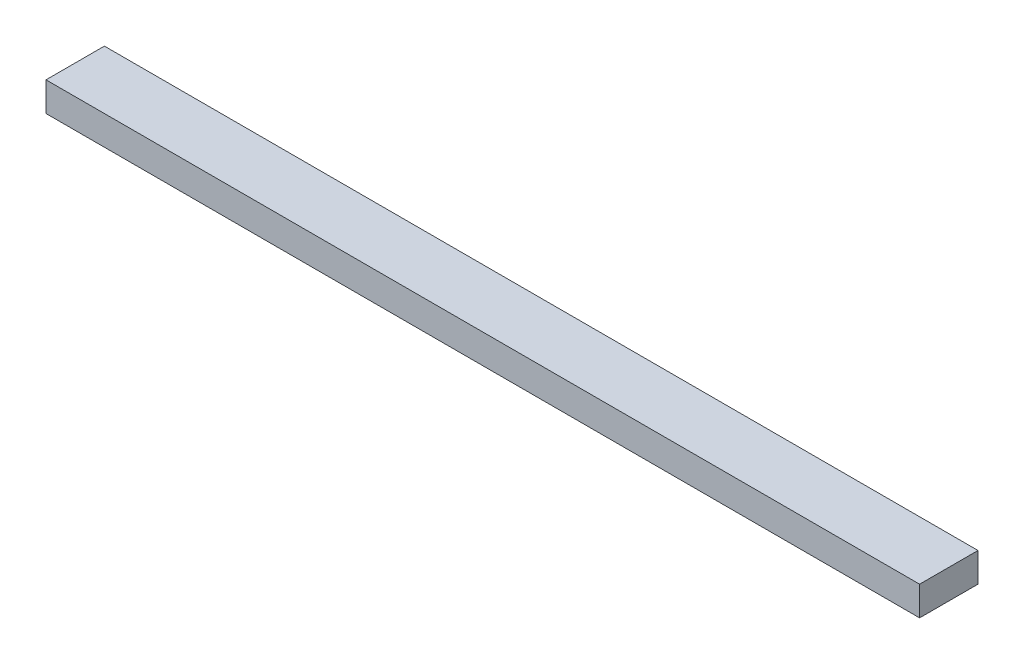
ISO-10303-21;
HEADER;
FILE_DESCRIPTION(('STEP AP214'),'2;1');
FILE_NAME('part.step','',(''),(''),'','','');
FILE_SCHEMA(('AUTOMOTIVE_DESIGN { 1 0 10303 214 1 1 1 1 }'));
ENDSEC;
DATA;
#1=APPLICATION_CONTEXT('core data for automotive mechanical design processes');
#2=APPLICATION_PROTOCOL_DEFINITION('international standard','automotive_design',2000,#1);
#3=PRODUCT_CONTEXT('',#1,'mechanical');
#4=PRODUCT('Part','Part','',(#3));
#5=PRODUCT_RELATED_PRODUCT_CATEGORY('part','',(#4));
#6=PRODUCT_DEFINITION_FORMATION('','',#4);
#7=PRODUCT_DEFINITION_CONTEXT('part definition',#1,'design');
#8=PRODUCT_DEFINITION('design','',#6,#7);
#9=PRODUCT_DEFINITION_SHAPE('','',#8);
#10=(LENGTH_UNIT() NAMED_UNIT(*) SI_UNIT(.MILLI.,.METRE.));
#11=(NAMED_UNIT(*) PLANE_ANGLE_UNIT() SI_UNIT($,.RADIAN.));
#12=(NAMED_UNIT(*) SI_UNIT($,.STERADIAN.) SOLID_ANGLE_UNIT());
#13=UNCERTAINTY_MEASURE_WITH_UNIT(LENGTH_MEASURE(1.E-05),#10,'distance_accuracy_value','');
#14=(GEOMETRIC_REPRESENTATION_CONTEXT(3) GLOBAL_UNCERTAINTY_ASSIGNED_CONTEXT((#13)) GLOBAL_UNIT_ASSIGNED_CONTEXT((#10,
#11,#12)) REPRESENTATION_CONTEXT('',''));
#15=CARTESIAN_POINT('',(0.,0.,0.));
#16=DIRECTION('',(0.,0.,1.));
#17=DIRECTION('',(1.,0.,0.));
#18=AXIS2_PLACEMENT_3D('',#15,#16,#17);
#19=CARTESIAN_POINT('',(0.,19.05,0.));
#20=DIRECTION('',(1.,0.,0.));
#21=DIRECTION('',(0.,0.,-1.));
#22=AXIS2_PLACEMENT_3D('',#19,#20,#21);
#23=PLANE('',#22);
#24=DIRECTION('',(0.,0.,1.));
#25=VECTOR('',#24,1.);
#26=CARTESIAN_POINT('',(0.,0.,0.));
#27=LINE('',#26,#25);
#28=CARTESIAN_POINT('',(0.,0.,-38.1));
#29=VERTEX_POINT('',#28);
#30=CARTESIAN_POINT('',(0.,0.,0.));
#31=VERTEX_POINT('',#30);
#32=EDGE_CURVE('E102',#29,#31,#27,.T.);
#33=ORIENTED_EDGE('',*,*,#32,.T.);
#34=DIRECTION('',(0.,-1.,0.));
#35=VECTOR('',#34,1.);
#36=CARTESIAN_POINT('',(0.,19.05,0.));
#37=LINE('',#36,#35);
#38=CARTESIAN_POINT('',(0.,19.05,0.));
#39=VERTEX_POINT('',#38);
#40=EDGE_CURVE('E11',#39,#31,#37,.T.);
#41=ORIENTED_EDGE('',*,*,#40,.F.);
#42=DIRECTION('',(0.,0.,1.));
#43=VECTOR('',#42,1.);
#44=CARTESIAN_POINT('',(0.,19.05,0.));
#45=LINE('',#44,#43);
#46=CARTESIAN_POINT('',(0.,19.05,-38.1));
#47=VERTEX_POINT('',#46);
#48=EDGE_CURVE('E90',#47,#39,#45,.T.);
#49=ORIENTED_EDGE('',*,*,#48,.F.);
#50=DIRECTION('',(0.,-1.,0.));
#51=VECTOR('',#50,1.);
#52=CARTESIAN_POINT('',(0.,19.05,-38.1));
#53=LINE('',#52,#51);
#54=EDGE_CURVE('E98',#47,#29,#53,.T.);
#55=ORIENTED_EDGE('',*,*,#54,.T.);
#56=EDGE_LOOP('',(#33,#41,#49,#55));
#57=FACE_BOUND('',#56,.T.);
#58=ADVANCED_FACE('F39',(#57),#23,.F.);
#59=CARTESIAN_POINT('',(0.,19.05,0.));
#60=DIRECTION('',(0.,0.,-1.));
#61=DIRECTION('',(-1.,0.,0.));
#62=AXIS2_PLACEMENT_3D('',#59,#60,#61);
#63=PLANE('',#62);
#64=DIRECTION('',(1.,0.,0.));
#65=VECTOR('',#64,1.);
#66=CARTESIAN_POINT('',(0.,0.,0.));
#67=LINE('',#66,#65);
#68=CARTESIAN_POINT('',(569.9125,0.,0.));
#69=VERTEX_POINT('',#68);
#70=EDGE_CURVE('E94',#31,#69,#67,.T.);
#71=ORIENTED_EDGE('',*,*,#70,.T.);
#72=DIRECTION('',(0.,-1.,0.));
#73=VECTOR('',#72,1.);
#74=CARTESIAN_POINT('',(569.9125,19.05,0.));
#75=LINE('',#74,#73);
#76=CARTESIAN_POINT('',(569.9125,19.05,0.));
#77=VERTEX_POINT('',#76);
#78=EDGE_CURVE('E47',#77,#69,#75,.T.);
#79=ORIENTED_EDGE('',*,*,#78,.F.);
#80=DIRECTION('',(1.,0.,0.));
#81=VECTOR('',#80,1.);
#82=CARTESIAN_POINT('',(0.,19.05,0.));
#83=LINE('',#82,#81);
#84=EDGE_CURVE('E85',#39,#77,#83,.T.);
#85=ORIENTED_EDGE('',*,*,#84,.F.);
#86=ORIENTED_EDGE('',*,*,#40,.T.);
#87=EDGE_LOOP('',(#71,#79,#85,#86));
#88=FACE_BOUND('',#87,.T.);
#89=ADVANCED_FACE('F93',(#88),#63,.F.);
#90=CARTESIAN_POINT('',(569.9125,19.05,0.));
#91=DIRECTION('',(-1.,0.,0.));
#92=DIRECTION('',(0.,0.,1.));
#93=AXIS2_PLACEMENT_3D('',#90,#91,#92);
#94=PLANE('',#93);
#95=DIRECTION('',(0.,0.,-1.));
#96=VECTOR('',#95,1.);
#97=CARTESIAN_POINT('',(569.9125,0.,0.));
#98=LINE('',#97,#96);
#99=CARTESIAN_POINT('',(569.9125,0.,-38.1));
#100=VERTEX_POINT('',#99);
#101=EDGE_CURVE('E72',#69,#100,#98,.T.);
#102=ORIENTED_EDGE('',*,*,#101,.T.);
#103=DIRECTION('',(0.,-1.,0.));
#104=VECTOR('',#103,1.);
#105=CARTESIAN_POINT('',(569.9125,19.05,-38.1));
#106=LINE('',#105,#104);
#107=CARTESIAN_POINT('',(569.9125,19.05,-38.1));
#108=VERTEX_POINT('',#107);
#109=EDGE_CURVE('E95',#108,#100,#106,.T.);
#110=ORIENTED_EDGE('',*,*,#109,.F.);
#111=DIRECTION('',(0.,0.,-1.));
#112=VECTOR('',#111,1.);
#113=CARTESIAN_POINT('',(569.9125,19.05,0.));
#114=LINE('',#113,#112);
#115=EDGE_CURVE('E88',#77,#108,#114,.T.);
#116=ORIENTED_EDGE('',*,*,#115,.F.);
#117=ORIENTED_EDGE('',*,*,#78,.T.);
#118=EDGE_LOOP('',(#102,#110,#116,#117));
#119=FACE_BOUND('',#118,.T.);
#120=ADVANCED_FACE('F96',(#119),#94,.F.);
#121=CARTESIAN_POINT('',(0.,19.05,-38.1));
#122=DIRECTION('',(0.,0.,1.));
#123=DIRECTION('',(1.,0.,0.));
#124=AXIS2_PLACEMENT_3D('',#121,#122,#123);
#125=PLANE('',#124);
#126=DIRECTION('',(-1.,0.,0.));
#127=VECTOR('',#126,1.);
#128=CARTESIAN_POINT('',(0.,0.,-38.1));
#129=LINE('',#128,#127);
#130=EDGE_CURVE('E78',#100,#29,#129,.T.);
#131=ORIENTED_EDGE('',*,*,#130,.T.);
#132=ORIENTED_EDGE('',*,*,#54,.F.);
#133=DIRECTION('',(-1.,0.,0.));
#134=VECTOR('',#133,1.);
#135=CARTESIAN_POINT('',(0.,19.05,-38.1));
#136=LINE('',#135,#134);
#137=EDGE_CURVE('E55',#108,#47,#136,.T.);
#138=ORIENTED_EDGE('',*,*,#137,.F.);
#139=ORIENTED_EDGE('',*,*,#109,.T.);
#140=EDGE_LOOP('',(#131,#132,#138,#139));
#141=FACE_BOUND('',#140,.T.);
#142=ADVANCED_FACE('F109',(#141),#125,.F.);
#143=CARTESIAN_POINT('',(0.,19.05,0.));
#144=DIRECTION('',(0.,-1.,0.));
#145=DIRECTION('',(0.,0.,-1.));
#146=AXIS2_PLACEMENT_3D('',#143,#144,#145);
#147=PLANE('',#146);
#148=ORIENTED_EDGE('',*,*,#48,.T.);
#149=ORIENTED_EDGE('',*,*,#84,.T.);
#150=ORIENTED_EDGE('',*,*,#115,.T.);
#151=ORIENTED_EDGE('',*,*,#137,.T.);
#152=EDGE_LOOP('',(#148,#149,#150,#151));
#153=FACE_BOUND('',#152,.T.);
#154=ADVANCED_FACE('F86',(#153),#147,.F.);
#155=CARTESIAN_POINT('',(0.,0.,0.));
#156=DIRECTION('',(0.,-1.,0.));
#157=DIRECTION('',(0.,0.,-1.));
#158=AXIS2_PLACEMENT_3D('',#155,#156,#157);
#159=PLANE('',#158);
#160=ORIENTED_EDGE('',*,*,#32,.F.);
#161=ORIENTED_EDGE('',*,*,#130,.F.);
#162=ORIENTED_EDGE('',*,*,#101,.F.);
#163=ORIENTED_EDGE('',*,*,#70,.F.);
#164=EDGE_LOOP('',(#160,#161,#162,#163));
#165=FACE_BOUND('',#164,.T.);
#166=ADVANCED_FACE('F112',(#165),#159,.T.);
#167=CLOSED_SHELL('',(#58,#89,#120,#142,#154,#166));
#168=MANIFOLD_SOLID_BREP('B2',#167);
#169=ADVANCED_BREP_SHAPE_REPRESENTATION('',(#18,#168),#14);
#170=SHAPE_DEFINITION_REPRESENTATION(#9,#169);
ENDSEC;
END-ISO-10303-21;
